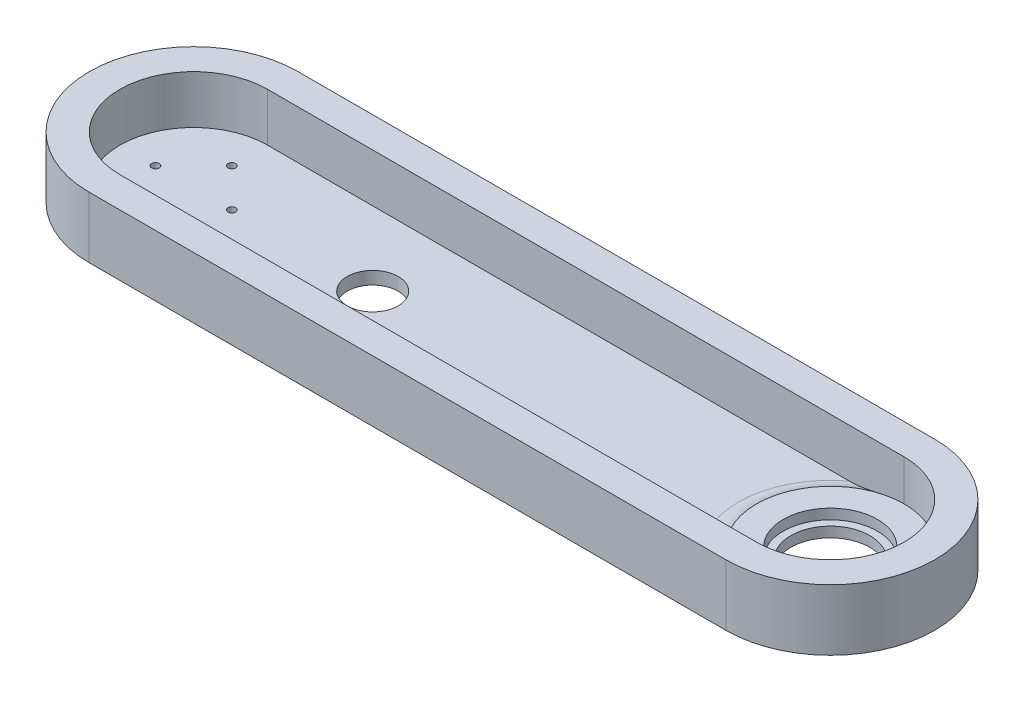
ISO-10303-21;
HEADER;
FILE_DESCRIPTION(('STEP AP214'),'2;1');
FILE_NAME('part.step','',(''),(''),'','','');
FILE_SCHEMA(('AUTOMOTIVE_DESIGN { 1 0 10303 214 1 1 1 1 }'));
ENDSEC;
DATA;
#1=APPLICATION_CONTEXT('core data for automotive mechanical design processes');
#2=APPLICATION_PROTOCOL_DEFINITION('international standard','automotive_design',2000,#1);
#3=PRODUCT_CONTEXT('',#1,'mechanical');
#4=PRODUCT('Part','Part','',(#3));
#5=PRODUCT_RELATED_PRODUCT_CATEGORY('part','',(#4));
#6=PRODUCT_DEFINITION_FORMATION('','',#4);
#7=PRODUCT_DEFINITION_CONTEXT('part definition',#1,'design');
#8=PRODUCT_DEFINITION('design','',#6,#7);
#9=PRODUCT_DEFINITION_SHAPE('','',#8);
#10=(LENGTH_UNIT() NAMED_UNIT(*) SI_UNIT(.MILLI.,.METRE.));
#11=(NAMED_UNIT(*) PLANE_ANGLE_UNIT() SI_UNIT($,.RADIAN.));
#12=(NAMED_UNIT(*) SI_UNIT($,.STERADIAN.) SOLID_ANGLE_UNIT());
#13=UNCERTAINTY_MEASURE_WITH_UNIT(LENGTH_MEASURE(1.E-05),#10,'distance_accuracy_value','');
#14=(GEOMETRIC_REPRESENTATION_CONTEXT(3) GLOBAL_UNCERTAINTY_ASSIGNED_CONTEXT((#13)) GLOBAL_UNIT_ASSIGNED_CONTEXT((#10,
#11,#12)) REPRESENTATION_CONTEXT('',''));
#15=CARTESIAN_POINT('',(0.,0.,0.));
#16=DIRECTION('',(0.,0.,1.));
#17=DIRECTION('',(1.,0.,0.));
#18=AXIS2_PLACEMENT_3D('',#15,#16,#17);
#19=CARTESIAN_POINT('',(0.,0.,0.));
#20=DIRECTION('',(0.,1.,0.));
#21=DIRECTION('',(0.,0.,1.));
#22=AXIS2_PLACEMENT_3D('',#19,#20,#21);
#23=PLANE('',#22);
#24=CARTESIAN_POINT('',(70.3,0.,0.));
#25=DIRECTION('',(0.,1.,0.));
#26=DIRECTION('',(0.,0.,1.));
#27=AXIS2_PLACEMENT_3D('',#24,#25,#26);
#28=CIRCLE('',#27,9.99999999999999);
#29=CARTESIAN_POINT('',(70.3,0.,9.99999999999999));
#30=VERTEX_POINT('',#29);
#31=EDGE_CURVE('E186',#30,#30,#28,.T.);
#32=ORIENTED_EDGE('',*,*,#31,.F.);
#33=EDGE_LOOP('',(#32));
#34=FACE_BOUND('',#33,.T.);
#35=CARTESIAN_POINT('',(15.0000000000004,0.,-4.24488671257339E-13));
#36=DIRECTION('',(0.,1.,0.));
#37=DIRECTION('',(0.,0.,1.));
#38=AXIS2_PLACEMENT_3D('',#35,#36,#37);
#39=CIRCLE('',#38,1.50000000000033);
#40=CARTESIAN_POINT('',(15.0000000000004,0.,1.49999999999991));
#41=VERTEX_POINT('',#40);
#42=EDGE_CURVE('E190',#41,#41,#39,.T.);
#43=ORIENTED_EDGE('',*,*,#42,.F.);
#44=EDGE_LOOP('',(#43));
#45=FACE_BOUND('',#44,.T.);
#46=CARTESIAN_POINT('',(8.48977342514678E-13,0.,15.));
#47=DIRECTION('',(0.,1.,0.));
#48=DIRECTION('',(0.,0.,1.));
#49=AXIS2_PLACEMENT_3D('',#46,#47,#48);
#50=CIRCLE('',#49,1.50000000000091);
#51=CARTESIAN_POINT('',(8.48977342514678E-13,0.,16.5000000000009));
#52=VERTEX_POINT('',#51);
#53=EDGE_CURVE('E194',#52,#52,#50,.T.);
#54=ORIENTED_EDGE('',*,*,#53,.F.);
#55=EDGE_LOOP('',(#54));
#56=FACE_BOUND('',#55,.T.);
#57=CARTESIAN_POINT('',(-14.9999999999996,0.,4.2632564145606E-13));
#58=DIRECTION('',(0.,1.,0.));
#59=DIRECTION('',(0.,0.,1.));
#60=AXIS2_PLACEMENT_3D('',#57,#58,#59);
#61=CIRCLE('',#60,1.50000000000068);
#62=CARTESIAN_POINT('',(-14.9999999999996,0.,1.50000000000111));
#63=VERTEX_POINT('',#62);
#64=EDGE_CURVE('E198',#63,#63,#61,.T.);
#65=ORIENTED_EDGE('',*,*,#64,.F.);
#66=EDGE_LOOP('',(#65));
#67=FACE_BOUND('',#66,.T.);
#68=CARTESIAN_POINT('',(0.,0.,-15.));
#69=DIRECTION('',(0.,1.,0.));
#70=DIRECTION('',(0.,0.,1.));
#71=AXIS2_PLACEMENT_3D('',#68,#69,#70);
#72=CIRCLE('',#71,1.5);
#73=CARTESIAN_POINT('',(0.,0.,-13.5));
#74=VERTEX_POINT('',#73);
#75=EDGE_CURVE('E201',#74,#74,#72,.T.);
#76=ORIENTED_EDGE('',*,*,#75,.F.);
#77=EDGE_LOOP('',(#76));
#78=FACE_BOUND('',#77,.T.);
#79=DIRECTION('',(1.,0.,0.));
#80=VECTOR('',#79,1.);
#81=CARTESIAN_POINT('',(0.,0.,29.));
#82=LINE('',#81,#80);
#83=CARTESIAN_POINT('',(0.,0.,29.));
#84=VERTEX_POINT('',#83);
#85=CARTESIAN_POINT('',(228.431438414779,0.,29.));
#86=VERTEX_POINT('',#85);
#87=EDGE_CURVE('E203',#84,#86,#82,.T.);
#88=ORIENTED_EDGE('',*,*,#87,.T.);
#89=CARTESIAN_POINT('',(250.,0.,0.));
#90=DIRECTION('',(0.,1.,0.));
#91=DIRECTION('',(0.,0.,1.));
#92=AXIS2_PLACEMENT_3D('',#89,#90,#91);
#93=CIRCLE('',#92,36.1414284285429);
#94=CARTESIAN_POINT('',(228.431438414779,0.,-29.));
#95=VERTEX_POINT('',#94);
#96=EDGE_CURVE('E130',#86,#95,#93,.F.);
#97=ORIENTED_EDGE('',*,*,#96,.T.);
#98=DIRECTION('',(-1.,0.,0.));
#99=VECTOR('',#98,1.);
#100=CARTESIAN_POINT('',(0.,0.,-29.));
#101=LINE('',#100,#99);
#102=CARTESIAN_POINT('',(0.,0.,-29.));
#103=VERTEX_POINT('',#102);
#104=EDGE_CURVE('E207',#95,#103,#101,.T.);
#105=ORIENTED_EDGE('',*,*,#104,.T.);
#106=CARTESIAN_POINT('',(0.,0.,0.));
#107=DIRECTION('',(0.,1.,0.));
#108=DIRECTION('',(0.,0.,1.));
#109=AXIS2_PLACEMENT_3D('',#106,#107,#108);
#110=CIRCLE('',#109,29.);
#111=EDGE_CURVE('E205',#103,#84,#110,.T.);
#112=ORIENTED_EDGE('',*,*,#111,.T.);
#113=EDGE_LOOP('',(#88,#97,#105,#112));
#114=FACE_BOUND('',#113,.T.);
#115=ADVANCED_FACE('F35',(#34,#45,#56,#67,#78,#114),#23,.T.);
#116=CARTESIAN_POINT('',(0.,19.,0.));
#117=DIRECTION('',(0.,1.,0.));
#118=DIRECTION('',(0.,0.,1.));
#119=AXIS2_PLACEMENT_3D('',#116,#117,#118);
#120=PLANE('',#119);
#121=CARTESIAN_POINT('',(0.,19.,0.));
#122=DIRECTION('',(0.,1.,0.));
#123=DIRECTION('',(0.,0.,1.));
#124=AXIS2_PLACEMENT_3D('',#121,#122,#123);
#125=CIRCLE('',#124,41.);
#126=CARTESIAN_POINT('',(0.,19.,-41.));
#127=VERTEX_POINT('',#126);
#128=CARTESIAN_POINT('',(0.,19.,41.));
#129=VERTEX_POINT('',#128);
#130=EDGE_CURVE('E221',#127,#129,#125,.T.);
#131=ORIENTED_EDGE('',*,*,#130,.T.);
#132=DIRECTION('',(1.,0.,0.));
#133=VECTOR('',#132,1.);
#134=CARTESIAN_POINT('',(0.,19.,41.));
#135=LINE('',#134,#133);
#136=CARTESIAN_POINT('',(250.,19.,41.));
#137=VERTEX_POINT('',#136);
#138=EDGE_CURVE('E224',#129,#137,#135,.T.);
#139=ORIENTED_EDGE('',*,*,#138,.T.);
#140=CARTESIAN_POINT('',(250.,19.,0.));
#141=DIRECTION('',(0.,1.,0.));
#142=DIRECTION('',(0.,0.,1.));
#143=AXIS2_PLACEMENT_3D('',#140,#141,#142);
#144=CIRCLE('',#143,41.);
#145=CARTESIAN_POINT('',(250.,19.,-41.));
#146=VERTEX_POINT('',#145);
#147=EDGE_CURVE('E226',#137,#146,#144,.T.);
#148=ORIENTED_EDGE('',*,*,#147,.T.);
#149=DIRECTION('',(-1.,0.,0.));
#150=VECTOR('',#149,1.);
#151=CARTESIAN_POINT('',(0.,19.,-41.));
#152=LINE('',#151,#150);
#153=EDGE_CURVE('E228',#146,#127,#152,.T.);
#154=ORIENTED_EDGE('',*,*,#153,.T.);
#155=EDGE_LOOP('',(#131,#139,#148,#154));
#156=FACE_BOUND('',#155,.T.);
#157=DIRECTION('',(1.,0.,0.));
#158=VECTOR('',#157,1.);
#159=CARTESIAN_POINT('',(0.,19.,29.));
#160=LINE('',#159,#158);
#161=CARTESIAN_POINT('',(0.,19.,29.));
#162=VERTEX_POINT('',#161);
#163=CARTESIAN_POINT('',(250.,19.,29.));
#164=VERTEX_POINT('',#163);
#165=EDGE_CURVE('E127',#162,#164,#160,.T.);
#166=ORIENTED_EDGE('',*,*,#165,.F.);
#167=CARTESIAN_POINT('',(0.,19.,0.));
#168=DIRECTION('',(0.,1.,0.));
#169=DIRECTION('',(0.,0.,1.));
#170=AXIS2_PLACEMENT_3D('',#167,#168,#169);
#171=CIRCLE('',#170,29.);
#172=CARTESIAN_POINT('',(0.,19.,-29.));
#173=VERTEX_POINT('',#172);
#174=EDGE_CURVE('E209',#173,#162,#171,.T.);
#175=ORIENTED_EDGE('',*,*,#174,.F.);
#176=DIRECTION('',(-1.,0.,0.));
#177=VECTOR('',#176,1.);
#178=CARTESIAN_POINT('',(0.,19.,-29.));
#179=LINE('',#178,#177);
#180=CARTESIAN_POINT('',(250.,19.,-29.));
#181=VERTEX_POINT('',#180);
#182=EDGE_CURVE('E218',#181,#173,#179,.T.);
#183=ORIENTED_EDGE('',*,*,#182,.F.);
#184=CARTESIAN_POINT('',(250.,19.,0.));
#185=DIRECTION('',(0.,1.,0.));
#186=DIRECTION('',(0.,0.,1.));
#187=AXIS2_PLACEMENT_3D('',#184,#185,#186);
#188=CIRCLE('',#187,29.);
#189=EDGE_CURVE('E260',#164,#181,#188,.T.);
#190=ORIENTED_EDGE('',*,*,#189,.F.);
#191=EDGE_LOOP('',(#166,#175,#183,#190));
#192=FACE_BOUND('',#191,.T.);
#193=ADVANCED_FACE('F160',(#156,#192),#120,.T.);
#194=CARTESIAN_POINT('',(0.,19.,0.));
#195=DIRECTION('',(0.,-1.,0.));
#196=DIRECTION('',(0.,0.,-1.));
#197=AXIS2_PLACEMENT_3D('',#194,#195,#196);
#198=CYLINDRICAL_SURFACE('',#197,41.);
#199=DIRECTION('',(0.,-1.,0.));
#200=VECTOR('',#199,1.);
#201=CARTESIAN_POINT('',(0.,19.,-41.));
#202=LINE('',#201,#200);
#203=CARTESIAN_POINT('',(0.,-5.,-41.));
#204=VERTEX_POINT('',#203);
#205=EDGE_CURVE('E230',#127,#204,#202,.T.);
#206=ORIENTED_EDGE('',*,*,#205,.T.);
#207=CARTESIAN_POINT('',(0.,-5.,0.));
#208=DIRECTION('',(0.,1.,0.));
#209=DIRECTION('',(0.,0.,1.));
#210=AXIS2_PLACEMENT_3D('',#207,#208,#209);
#211=CIRCLE('',#210,41.);
#212=CARTESIAN_POINT('',(0.,-5.,41.));
#213=VERTEX_POINT('',#212);
#214=EDGE_CURVE('E211',#204,#213,#211,.T.);
#215=ORIENTED_EDGE('',*,*,#214,.T.);
#216=DIRECTION('',(0.,-1.,0.));
#217=VECTOR('',#216,1.);
#218=CARTESIAN_POINT('',(0.,19.,41.));
#219=LINE('',#218,#217);
#220=EDGE_CURVE('E133',#129,#213,#219,.T.);
#221=ORIENTED_EDGE('',*,*,#220,.F.);
#222=ORIENTED_EDGE('',*,*,#130,.F.);
#223=EDGE_LOOP('',(#206,#215,#221,#222));
#224=FACE_BOUND('',#223,.T.);
#225=ADVANCED_FACE('F163',(#224),#198,.T.);
#226=CARTESIAN_POINT('',(0.,19.,41.));
#227=DIRECTION('',(0.,0.,-1.));
#228=DIRECTION('',(-1.,0.,0.));
#229=AXIS2_PLACEMENT_3D('',#226,#227,#228);
#230=PLANE('',#229);
#231=ORIENTED_EDGE('',*,*,#220,.T.);
#232=DIRECTION('',(1.,0.,0.));
#233=VECTOR('',#232,1.);
#234=CARTESIAN_POINT('',(0.,-5.,41.));
#235=LINE('',#234,#233);
#236=CARTESIAN_POINT('',(250.,-5.,41.));
#237=VERTEX_POINT('',#236);
#238=EDGE_CURVE('E245',#213,#237,#235,.T.);
#239=ORIENTED_EDGE('',*,*,#238,.T.);
#240=DIRECTION('',(0.,-1.,0.));
#241=VECTOR('',#240,1.);
#242=CARTESIAN_POINT('',(250.,19.,41.));
#243=LINE('',#242,#241);
#244=EDGE_CURVE('E135',#137,#237,#243,.T.);
#245=ORIENTED_EDGE('',*,*,#244,.F.);
#246=ORIENTED_EDGE('',*,*,#138,.F.);
#247=EDGE_LOOP('',(#231,#239,#245,#246));
#248=FACE_BOUND('',#247,.T.);
#249=ADVANCED_FACE('F171',(#248),#230,.F.);
#250=CARTESIAN_POINT('',(250.,19.,0.));
#251=DIRECTION('',(0.,-1.,0.));
#252=DIRECTION('',(0.,0.,-1.));
#253=AXIS2_PLACEMENT_3D('',#250,#251,#252);
#254=CYLINDRICAL_SURFACE('',#253,41.);
#255=ORIENTED_EDGE('',*,*,#244,.T.);
#256=CARTESIAN_POINT('',(250.,-5.,0.));
#257=DIRECTION('',(0.,1.,0.));
#258=DIRECTION('',(0.,0.,1.));
#259=AXIS2_PLACEMENT_3D('',#256,#257,#258);
#260=CIRCLE('',#259,41.);
#261=CARTESIAN_POINT('',(250.,-5.,-41.));
#262=VERTEX_POINT('',#261);
#263=EDGE_CURVE('E239',#237,#262,#260,.T.);
#264=ORIENTED_EDGE('',*,*,#263,.T.);
#265=DIRECTION('',(0.,-1.,0.));
#266=VECTOR('',#265,1.);
#267=CARTESIAN_POINT('',(250.,19.,-41.));
#268=LINE('',#267,#266);
#269=EDGE_CURVE('E232',#146,#262,#268,.T.);
#270=ORIENTED_EDGE('',*,*,#269,.F.);
#271=ORIENTED_EDGE('',*,*,#147,.F.);
#272=EDGE_LOOP('',(#255,#264,#270,#271));
#273=FACE_BOUND('',#272,.T.);
#274=ADVANCED_FACE('F167',(#273),#254,.T.);
#275=CARTESIAN_POINT('',(0.,19.,-41.));
#276=DIRECTION('',(0.,0.,1.));
#277=DIRECTION('',(1.,0.,0.));
#278=AXIS2_PLACEMENT_3D('',#275,#276,#277);
#279=PLANE('',#278);
#280=ORIENTED_EDGE('',*,*,#269,.T.);
#281=DIRECTION('',(1.,0.,0.));
#282=VECTOR('',#281,1.);
#283=CARTESIAN_POINT('',(0.,-5.,-41.));
#284=LINE('',#283,#282);
#285=EDGE_CURVE('E248',#204,#262,#284,.T.);
#286=ORIENTED_EDGE('',*,*,#285,.F.);
#287=ORIENTED_EDGE('',*,*,#205,.F.);
#288=ORIENTED_EDGE('',*,*,#153,.F.);
#289=EDGE_LOOP('',(#280,#286,#287,#288));
#290=FACE_BOUND('',#289,.T.);
#291=ADVANCED_FACE('F158',(#290),#279,.F.);
#292=CARTESIAN_POINT('',(0.,19.,0.));
#293=DIRECTION('',(0.,-1.,0.));
#294=DIRECTION('',(0.,0.,-1.));
#295=AXIS2_PLACEMENT_3D('',#292,#293,#294);
#296=CYLINDRICAL_SURFACE('',#295,29.);
#297=ORIENTED_EDGE('',*,*,#111,.F.);
#298=DIRECTION('',(0.,-1.,0.));
#299=VECTOR('',#298,1.);
#300=CARTESIAN_POINT('',(0.,19.,-29.));
#301=LINE('',#300,#299);
#302=EDGE_CURVE('E215',#173,#103,#301,.T.);
#303=ORIENTED_EDGE('',*,*,#302,.F.);
#304=ORIENTED_EDGE('',*,*,#174,.T.);
#305=DIRECTION('',(0.,-1.,0.));
#306=VECTOR('',#305,1.);
#307=CARTESIAN_POINT('',(0.,19.,29.));
#308=LINE('',#307,#306);
#309=EDGE_CURVE('E128',#162,#84,#308,.T.);
#310=ORIENTED_EDGE('',*,*,#309,.T.);
#311=EDGE_LOOP('',(#297,#303,#304,#310));
#312=FACE_BOUND('',#311,.T.);
#313=ADVANCED_FACE('F155',(#312),#296,.F.);
#314=CARTESIAN_POINT('',(0.,19.,29.));
#315=DIRECTION('',(0.,0.,-1.));
#316=DIRECTION('',(-1.,0.,0.));
#317=AXIS2_PLACEMENT_3D('',#314,#315,#316);
#318=PLANE('',#317);
#319=DIRECTION('',(0.,-1.,0.));
#320=VECTOR('',#319,1.);
#321=CARTESIAN_POINT('',(250.,19.,29.));
#322=LINE('',#321,#320);
#323=CARTESIAN_POINT('',(250.,3.,29.));
#324=VERTEX_POINT('',#323);
#325=EDGE_CURVE('E120',#164,#324,#322,.T.);
#326=ORIENTED_EDGE('',*,*,#325,.T.);
#327=CARTESIAN_POINT('',(250.,3.,29.));
#328=CARTESIAN_POINT('',(249.832493377356,3.00000367263061,29.));
#329=CARTESIAN_POINT('',(249.664990380621,2.9985188998757,29.));
#330=CARTESIAN_POINT('',(249.330039269559,2.99260478049942,29.));
#331=CARTESIAN_POINT('',(249.162591154308,2.98817548631364,29.));
#332=CARTESIAN_POINT('',(248.660485564545,2.97052251778616,29.));
#333=CARTESIAN_POINT('',(248.325972797857,2.95293372283741,29.));
#334=CARTESIAN_POINT('',(247.658627091689,2.90682313871172,29.));
#335=CARTESIAN_POINT('',(247.325792055736,2.87833103675042,29.));
#336=CARTESIAN_POINT('',(246.66111223066,2.81140950416254,29.));
#337=CARTESIAN_POINT('',(246.329267499912,2.77297949898823,29.));
#338=CARTESIAN_POINT('',(245.666817846843,2.687443630777,29.));
#339=CARTESIAN_POINT('',(245.336212562984,2.64034053760958,29.));
#340=CARTESIAN_POINT('',(244.67613608256,2.53884149075314,29.));
#341=CARTESIAN_POINT('',(244.346664878401,2.48444558599467,29.));
#342=CARTESIAN_POINT('',(243.359155528962,2.3123953016813,29.));
#343=CARTESIAN_POINT('',(242.702660035545,2.18596637017266,29.));
#344=CARTESIAN_POINT('',(241.485079640582,1.9399674063863,29.));
#345=CARTESIAN_POINT('',(240.923664748939,1.82196657385981,29.));
#346=CARTESIAN_POINT('',(239.801276777676,1.58383209028963,29.));
#347=CARTESIAN_POINT('',(239.24030370541,1.46369840449079,29.));
#348=CARTESIAN_POINT('',(238.11825457787,1.22748824284378,29.));
#349=CARTESIAN_POINT('',(237.557179606503,1.11140669088967,29.));
#350=CARTESIAN_POINT('',(236.433103705994,0.888636585884137,29.));
#351=CARTESIAN_POINT('',(235.870102667029,0.781948578042807,29.));
#352=CARTESIAN_POINT('',(234.739695176278,0.582831670789539,29.));
#353=CARTESIAN_POINT('',(234.172280414024,0.490449095875529,29.));
#354=CARTESIAN_POINT('',(233.034603708037,0.325419015592739,29.));
#355=CARTESIAN_POINT('',(232.464342082054,0.252769355783526,29.));
#356=CARTESIAN_POINT('',(231.318178299336,0.131906466672462,29.));
#357=CARTESIAN_POINT('',(230.742262210227,0.0838200060385131,29.));
#358=CARTESIAN_POINT('',(229.588148024831,0.0178691349203777,29.));
#359=CARTESIAN_POINT('',(229.009948180689,3.61368821550616E-05,29.));
#360=CARTESIAN_POINT('',(228.431438414779,0.,29.));
#361=B_SPLINE_CURVE_WITH_KNOTS('',3,(#327,#328,#329,#330,#331,#332,#333,#334,#335,#336,#337,
#338,#339,#340,#341,#342,#343,#344,#345,#346,#347,#348,#349,#350,#351,#352,#353,#354,#355,#356,
#357,#358,#359,#360),.UNSPECIFIED.,.F.,.F.,(4,2,2,2,2,2,2,2,2,2,2,2,2,2,2,2,4),(0.,
0.502506265709881,1.00500358310246,2.00971623130642,3.01171251944555,4.0137667497312,
5.01550151358301,6.01722955671074,8.02261757938016,9.74366545617356,11.4647414034875,
13.1835777648582,14.9025138234281,16.6269047818956,18.3511073955454,20.0841207854072,
21.8189324800552),.UNSPECIFIED.);
#362=EDGE_CURVE('E11',#324,#86,#361,.T.);
#363=ORIENTED_EDGE('',*,*,#362,.T.);
#364=ORIENTED_EDGE('',*,*,#87,.F.);
#365=ORIENTED_EDGE('',*,*,#309,.F.);
#366=ORIENTED_EDGE('',*,*,#165,.T.);
#367=EDGE_LOOP('',(#326,#363,#364,#365,#366));
#368=FACE_BOUND('',#367,.T.);
#369=ADVANCED_FACE('F124',(#368),#318,.T.);
#370=CARTESIAN_POINT('',(250.,19.,0.));
#371=DIRECTION('',(0.,-1.,0.));
#372=DIRECTION('',(0.,0.,-1.));
#373=AXIS2_PLACEMENT_3D('',#370,#371,#372);
#374=CYLINDRICAL_SURFACE('',#373,29.);
#375=CARTESIAN_POINT('',(250.,3.,0.));
#376=DIRECTION('',(0.,1.,0.));
#377=DIRECTION('',(0.,0.,1.));
#378=AXIS2_PLACEMENT_3D('',#375,#376,#377);
#379=CIRCLE('',#378,29.);
#380=CARTESIAN_POINT('',(250.,3.,-29.));
#381=VERTEX_POINT('',#380);
#382=EDGE_CURVE('E112',#324,#381,#379,.T.);
#383=ORIENTED_EDGE('',*,*,#382,.F.);
#384=ORIENTED_EDGE('',*,*,#325,.F.);
#385=ORIENTED_EDGE('',*,*,#189,.T.);
#386=DIRECTION('',(0.,-1.,0.));
#387=VECTOR('',#386,1.);
#388=CARTESIAN_POINT('',(250.,19.,-29.));
#389=LINE('',#388,#387);
#390=EDGE_CURVE('E122',#181,#381,#389,.T.);
#391=ORIENTED_EDGE('',*,*,#390,.T.);
#392=EDGE_LOOP('',(#383,#384,#385,#391));
#393=FACE_BOUND('',#392,.T.);
#394=ADVANCED_FACE('F118',(#393),#374,.F.);
#395=CARTESIAN_POINT('',(0.,19.,-29.));
#396=DIRECTION('',(0.,0.,1.));
#397=DIRECTION('',(1.,0.,0.));
#398=AXIS2_PLACEMENT_3D('',#395,#396,#397);
#399=PLANE('',#398);
#400=ORIENTED_EDGE('',*,*,#104,.F.);
#401=CARTESIAN_POINT('',(228.431438414779,0.,-29.));
#402=CARTESIAN_POINT('',(228.7712509574,5.30773564091231E-06,-29.));
#403=CARTESIAN_POINT('',(229.111011404756,0.00616809285598318,-29.));
#404=CARTESIAN_POINT('',(229.790063460882,0.0297169154421981,-29.));
#405=CARTESIAN_POINT('',(230.12935516613,0.0471001277119732,-29.));
#406=CARTESIAN_POINT('',(231.145021725049,0.114368246206919,-29.));
#407=CARTESIAN_POINT('',(231.820408098775,0.179379530768059,-29.));
#408=CARTESIAN_POINT('',(233.166581031963,0.341322058111444,-29.));
#409=CARTESIAN_POINT('',(233.837370986746,0.438226368006113,-29.));
#410=CARTESIAN_POINT('',(235.175465990828,0.655818383972155,-29.));
#411=CARTESIAN_POINT('',(235.842768362181,0.776522207382179,-29.));
#412=CARTESIAN_POINT('',(237.067227847358,1.01257222818366,-29.));
#413=CARTESIAN_POINT('',(237.624832005435,1.12565569701959,-29.));
#414=CARTESIAN_POINT('',(238.738898691866,1.35731126230573,-29.));
#415=CARTESIAN_POINT('',(239.295361193068,1.47588348775472,-29.));
#416=CARTESIAN_POINT('',(240.407722646888,1.71266395535803,-29.));
#417=CARTESIAN_POINT('',(240.963621546068,1.83087245442479,-29.));
#418=CARTESIAN_POINT('',(242.076843467326,2.06078866897682,-29.));
#419=CARTESIAN_POINT('',(242.634166613534,2.17249579616322,-29.));
#420=CARTESIAN_POINT('',(243.75274612407,2.38278730883891,-29.));
#421=CARTESIAN_POINT('',(244.314008777347,2.48133889697814,-29.));
#422=CARTESIAN_POINT('',(245.439682547898,2.65769097186664,-29.));
#423=CARTESIAN_POINT('',(246.00409235969,2.73549949164326,-29.));
#424=CARTESIAN_POINT('',(246.854489630497,2.83177237456654,-29.));
#425=CARTESIAN_POINT('',(247.139322428893,2.86050396734676,-29.));
#426=CARTESIAN_POINT('',(247.709654232686,2.91033660830311,-29.));
#427=CARTESIAN_POINT('',(247.995153217051,2.93143789418972,-29.));
#428=CARTESIAN_POINT('',(248.567059884556,2.96546191387092,-29.));
#429=CARTESIAN_POINT('',(248.853468285594,2.97837268727966,-29.));
#430=CARTESIAN_POINT('',(249.426581429478,2.9956631071147,-29.));
#431=CARTESIAN_POINT('',(249.713286208416,3.00004155034541,-29.));
#432=CARTESIAN_POINT('',(250.,2.99999999999964,-29.));
#433=B_SPLINE_CURVE_WITH_KNOTS('',3,(#401,#402,#403,#404,#405,#406,#407,#408,#409,#410,#411,
#412,#413,#414,#415,#416,#417,#418,#419,#420,#421,#422,#423,#424,#425,#426,#427,#428,#429,#430,
#431,#432),.UNSPECIFIED.,.F.,.F.,(4,2,2,2,2,2,2,2,2,2,2,2,2,2,2,4),(0.,1.01929970871869,
2.03834286759517,4.07277543747311,6.10549436775049,8.13959463914237,9.84641472354875,
11.5532749426588,13.2582575624579,14.9633942243308,16.6727054911769,18.3813538398808,
19.2401015696126,20.098822544074,20.9587946166991,21.8188879504262),.UNSPECIFIED.);
#434=EDGE_CURVE('E48',#95,#381,#433,.T.);
#435=ORIENTED_EDGE('',*,*,#434,.T.);
#436=ORIENTED_EDGE('',*,*,#390,.F.);
#437=ORIENTED_EDGE('',*,*,#182,.T.);
#438=ORIENTED_EDGE('',*,*,#302,.T.);
#439=EDGE_LOOP('',(#400,#435,#436,#437,#438));
#440=FACE_BOUND('',#439,.T.);
#441=ADVANCED_FACE('F143',(#440),#399,.T.);
#442=CARTESIAN_POINT('',(0.,-5.,0.));
#443=DIRECTION('',(0.,1.,0.));
#444=DIRECTION('',(0.,0.,1.));
#445=AXIS2_PLACEMENT_3D('',#442,#443,#444);
#446=PLANE('',#445);
#447=CARTESIAN_POINT('',(70.3,-5.,0.));
#448=DIRECTION('',(0.,1.,0.));
#449=DIRECTION('',(0.,0.,1.));
#450=AXIS2_PLACEMENT_3D('',#447,#448,#449);
#451=CIRCLE('',#450,9.99999999999999);
#452=CARTESIAN_POINT('',(70.3,-5.,9.99999999999999));
#453=VERTEX_POINT('',#452);
#454=EDGE_CURVE('E290',#453,#453,#451,.T.);
#455=ORIENTED_EDGE('',*,*,#454,.T.);
#456=EDGE_LOOP('',(#455));
#457=FACE_BOUND('',#456,.T.);
#458=CARTESIAN_POINT('',(250.,-5.,0.));
#459=DIRECTION('',(0.,1.,0.));
#460=DIRECTION('',(0.,0.,1.));
#461=AXIS2_PLACEMENT_3D('',#458,#459,#460);
#462=CIRCLE('',#461,15.5);
#463=CARTESIAN_POINT('',(250.,-5.,15.5));
#464=VERTEX_POINT('',#463);
#465=EDGE_CURVE('E286',#464,#464,#462,.T.);
#466=ORIENTED_EDGE('',*,*,#465,.T.);
#467=EDGE_LOOP('',(#466));
#468=FACE_BOUND('',#467,.T.);
#469=CARTESIAN_POINT('',(15.0000000000004,-5.,-4.24488671257339E-13));
#470=DIRECTION('',(0.,1.,0.));
#471=DIRECTION('',(0.,0.,1.));
#472=AXIS2_PLACEMENT_3D('',#469,#470,#471);
#473=CIRCLE('',#472,1.50000000000033);
#474=CARTESIAN_POINT('',(15.0000000000004,-5.,1.49999999999991));
#475=VERTEX_POINT('',#474);
#476=EDGE_CURVE('E273',#475,#475,#473,.T.);
#477=ORIENTED_EDGE('',*,*,#476,.T.);
#478=EDGE_LOOP('',(#477));
#479=FACE_BOUND('',#478,.T.);
#480=CARTESIAN_POINT('',(8.48977342514678E-13,-5.,15.));
#481=DIRECTION('',(0.,1.,0.));
#482=DIRECTION('',(0.,0.,1.));
#483=AXIS2_PLACEMENT_3D('',#480,#481,#482);
#484=CIRCLE('',#483,1.50000000000091);
#485=CARTESIAN_POINT('',(8.48977342514678E-13,-5.,16.5000000000009));
#486=VERTEX_POINT('',#485);
#487=EDGE_CURVE('E276',#486,#486,#484,.T.);
#488=ORIENTED_EDGE('',*,*,#487,.T.);
#489=EDGE_LOOP('',(#488));
#490=FACE_BOUND('',#489,.T.);
#491=CARTESIAN_POINT('',(-14.9999999999996,-5.,4.2632564145606E-13));
#492=DIRECTION('',(0.,1.,0.));
#493=DIRECTION('',(0.,0.,1.));
#494=AXIS2_PLACEMENT_3D('',#491,#492,#493);
#495=CIRCLE('',#494,1.50000000000068);
#496=CARTESIAN_POINT('',(-14.9999999999996,-5.,1.50000000000111));
#497=VERTEX_POINT('',#496);
#498=EDGE_CURVE('E123',#497,#497,#495,.T.);
#499=ORIENTED_EDGE('',*,*,#498,.T.);
#500=EDGE_LOOP('',(#499));
#501=FACE_BOUND('',#500,.T.);
#502=CARTESIAN_POINT('',(0.,-5.,-15.));
#503=DIRECTION('',(0.,1.,0.));
#504=DIRECTION('',(0.,0.,1.));
#505=AXIS2_PLACEMENT_3D('',#502,#503,#504);
#506=CIRCLE('',#505,1.5);
#507=CARTESIAN_POINT('',(0.,-5.,-13.5));
#508=VERTEX_POINT('',#507);
#509=EDGE_CURVE('E252',#508,#508,#506,.T.);
#510=ORIENTED_EDGE('',*,*,#509,.T.);
#511=EDGE_LOOP('',(#510));
#512=FACE_BOUND('',#511,.T.);
#513=ORIENTED_EDGE('',*,*,#238,.F.);
#514=ORIENTED_EDGE('',*,*,#214,.F.);
#515=ORIENTED_EDGE('',*,*,#285,.T.);
#516=ORIENTED_EDGE('',*,*,#263,.F.);
#517=EDGE_LOOP('',(#513,#514,#515,#516));
#518=FACE_BOUND('',#517,.T.);
#519=ADVANCED_FACE('F148',(#457,#468,#479,#490,#501,#512,#518),#446,.F.);
#520=CARTESIAN_POINT('',(0.,-5.,-15.));
#521=DIRECTION('',(0.,1.,0.));
#522=DIRECTION('',(0.,0.,1.));
#523=AXIS2_PLACEMENT_3D('',#520,#521,#522);
#524=CYLINDRICAL_SURFACE('',#523,1.5);
#525=ORIENTED_EDGE('',*,*,#75,.T.);
#526=EDGE_LOOP('',(#525));
#527=FACE_BOUND('',#526,.T.);
#528=ORIENTED_EDGE('',*,*,#509,.F.);
#529=EDGE_LOOP('',(#528));
#530=FACE_BOUND('',#529,.T.);
#531=ADVANCED_FACE('F330',(#527,#530),#524,.F.);
#532=CARTESIAN_POINT('',(-14.9999999999996,-5.,4.2632564145606E-13));
#533=DIRECTION('',(0.,1.,0.));
#534=DIRECTION('',(0.,0.,1.));
#535=AXIS2_PLACEMENT_3D('',#532,#533,#534);
#536=CYLINDRICAL_SURFACE('',#535,1.50000000000068);
#537=ORIENTED_EDGE('',*,*,#64,.T.);
#538=EDGE_LOOP('',(#537));
#539=FACE_BOUND('',#538,.T.);
#540=ORIENTED_EDGE('',*,*,#498,.F.);
#541=EDGE_LOOP('',(#540));
#542=FACE_BOUND('',#541,.T.);
#543=ADVANCED_FACE('F326',(#539,#542),#536,.F.);
#544=CARTESIAN_POINT('',(8.48977342514678E-13,-5.,15.));
#545=DIRECTION('',(0.,1.,0.));
#546=DIRECTION('',(0.,0.,1.));
#547=AXIS2_PLACEMENT_3D('',#544,#545,#546);
#548=CYLINDRICAL_SURFACE('',#547,1.50000000000091);
#549=ORIENTED_EDGE('',*,*,#53,.T.);
#550=EDGE_LOOP('',(#549));
#551=FACE_BOUND('',#550,.T.);
#552=ORIENTED_EDGE('',*,*,#487,.F.);
#553=EDGE_LOOP('',(#552));
#554=FACE_BOUND('',#553,.T.);
#555=ADVANCED_FACE('F322',(#551,#554),#548,.F.);
#556=CARTESIAN_POINT('',(15.0000000000004,-5.,-4.24488671257339E-13));
#557=DIRECTION('',(0.,1.,0.));
#558=DIRECTION('',(0.,0.,1.));
#559=AXIS2_PLACEMENT_3D('',#556,#557,#558);
#560=CYLINDRICAL_SURFACE('',#559,1.50000000000033);
#561=ORIENTED_EDGE('',*,*,#42,.T.);
#562=EDGE_LOOP('',(#561));
#563=FACE_BOUND('',#562,.T.);
#564=ORIENTED_EDGE('',*,*,#476,.F.);
#565=EDGE_LOOP('',(#564));
#566=FACE_BOUND('',#565,.T.);
#567=ADVANCED_FACE('F318',(#563,#566),#560,.F.);
#568=CARTESIAN_POINT('',(250.,3.,0.));
#569=DIRECTION('',(0.,1.,0.));
#570=DIRECTION('',(0.,0.,1.));
#571=AXIS2_PLACEMENT_3D('',#568,#569,#570);
#572=PLANE('',#571);
#573=CARTESIAN_POINT('',(250.,3.,0.));
#574=DIRECTION('',(0.,1.,0.));
#575=DIRECTION('',(0.,0.,1.));
#576=AXIS2_PLACEMENT_3D('',#573,#574,#575);
#577=CIRCLE('',#576,18.5);
#578=CARTESIAN_POINT('',(250.,3.,18.5));
#579=VERTEX_POINT('',#578);
#580=EDGE_CURVE('E281',#579,#579,#577,.T.);
#581=ORIENTED_EDGE('',*,*,#580,.F.);
#582=EDGE_LOOP('',(#581));
#583=FACE_BOUND('',#582,.T.);
#584=ORIENTED_EDGE('',*,*,#382,.T.);
#585=EDGE_CURVE('E109',#381,#324,#379,.T.);
#586=ORIENTED_EDGE('',*,*,#585,.T.);
#587=EDGE_LOOP('',(#584,#586));
#588=FACE_BOUND('',#587,.T.);
#589=ADVANCED_FACE('F111',(#583,#588),#572,.T.);
#590=CARTESIAN_POINT('',(250.,-1.,0.));
#591=DIRECTION('',(0.,1.,0.));
#592=DIRECTION('',(0.,0.,1.));
#593=AXIS2_PLACEMENT_3D('',#590,#591,#592);
#594=CYLINDRICAL_SURFACE('',#593,18.5);
#595=CARTESIAN_POINT('',(250.,-1.,0.));
#596=DIRECTION('',(0.,1.,0.));
#597=DIRECTION('',(0.,0.,1.));
#598=AXIS2_PLACEMENT_3D('',#595,#596,#597);
#599=CIRCLE('',#598,18.5);
#600=CARTESIAN_POINT('',(250.,-1.,18.5));
#601=VERTEX_POINT('',#600);
#602=EDGE_CURVE('E114',#601,#601,#599,.T.);
#603=ORIENTED_EDGE('',*,*,#602,.F.);
#604=EDGE_LOOP('',(#603));
#605=FACE_BOUND('',#604,.T.);
#606=ORIENTED_EDGE('',*,*,#580,.T.);
#607=EDGE_LOOP('',(#606));
#608=FACE_BOUND('',#607,.T.);
#609=ADVANCED_FACE('F311',(#605,#608),#594,.F.);
#610=CARTESIAN_POINT('',(250.,-1.,0.));
#611=DIRECTION('',(0.,1.,0.));
#612=DIRECTION('',(0.,0.,1.));
#613=AXIS2_PLACEMENT_3D('',#610,#611,#612);
#614=PLANE('',#613);
#615=CARTESIAN_POINT('',(250.,-1.,0.));
#616=DIRECTION('',(0.,1.,0.));
#617=DIRECTION('',(0.,0.,1.));
#618=AXIS2_PLACEMENT_3D('',#615,#616,#617);
#619=CIRCLE('',#618,15.5);
#620=CARTESIAN_POINT('',(250.,-1.,15.5));
#621=VERTEX_POINT('',#620);
#622=EDGE_CURVE('E138',#621,#621,#619,.T.);
#623=ORIENTED_EDGE('',*,*,#622,.F.);
#624=EDGE_LOOP('',(#623));
#625=FACE_BOUND('',#624,.T.);
#626=ORIENTED_EDGE('',*,*,#602,.T.);
#627=EDGE_LOOP('',(#626));
#628=FACE_BOUND('',#627,.T.);
#629=ADVANCED_FACE('F307',(#625,#628),#614,.T.);
#630=CARTESIAN_POINT('',(250.,-5.,0.));
#631=DIRECTION('',(0.,1.,0.));
#632=DIRECTION('',(0.,0.,1.));
#633=AXIS2_PLACEMENT_3D('',#630,#631,#632);
#634=CYLINDRICAL_SURFACE('',#633,15.5);
#635=ORIENTED_EDGE('',*,*,#622,.T.);
#636=EDGE_LOOP('',(#635));
#637=FACE_BOUND('',#636,.T.);
#638=ORIENTED_EDGE('',*,*,#465,.F.);
#639=EDGE_LOOP('',(#638));
#640=FACE_BOUND('',#639,.T.);
#641=ADVANCED_FACE('F303',(#637,#640),#634,.F.);
#642=CARTESIAN_POINT('',(250.,10.,0.));
#643=DIRECTION('',(0.,1.,0.));
#644=DIRECTION('',(0.,0.,1.));
#645=AXIS2_PLACEMENT_3D('',#642,#643,#644);
#646=TOROIDAL_SURFACE('',#645,36.1414284285429,10.);
#647=ORIENTED_EDGE('',*,*,#362,.F.);
#648=ORIENTED_EDGE('',*,*,#585,.F.);
#649=ORIENTED_EDGE('',*,*,#434,.F.);
#650=ORIENTED_EDGE('',*,*,#96,.F.);
#651=EDGE_LOOP('',(#647,#648,#649,#650));
#652=FACE_BOUND('',#651,.T.);
#653=ADVANCED_FACE('F37',(#652),#646,.F.);
#654=CARTESIAN_POINT('',(70.3,-5.,0.));
#655=DIRECTION('',(0.,1.,0.));
#656=DIRECTION('',(0.,0.,1.));
#657=AXIS2_PLACEMENT_3D('',#654,#655,#656);
#658=CYLINDRICAL_SURFACE('',#657,9.99999999999999);
#659=ORIENTED_EDGE('',*,*,#31,.T.);
#660=EDGE_LOOP('',(#659));
#661=FACE_BOUND('',#660,.T.);
#662=ORIENTED_EDGE('',*,*,#454,.F.);
#663=EDGE_LOOP('',(#662));
#664=FACE_BOUND('',#663,.T.);
#665=ADVANCED_FACE('F296',(#661,#664),#658,.F.);
#666=CLOSED_SHELL('',(#115,#193,#225,#249,#274,#291,#313,#369,#394,#441,#519,#531,#543,#555,
#567,#589,#609,#629,#641,#653,#665));
#667=MANIFOLD_SOLID_BREP('B2',#666);
#668=ADVANCED_BREP_SHAPE_REPRESENTATION('',(#18,#667),#14);
#669=SHAPE_DEFINITION_REPRESENTATION(#9,#668);
ENDSEC;
END-ISO-10303-21;
